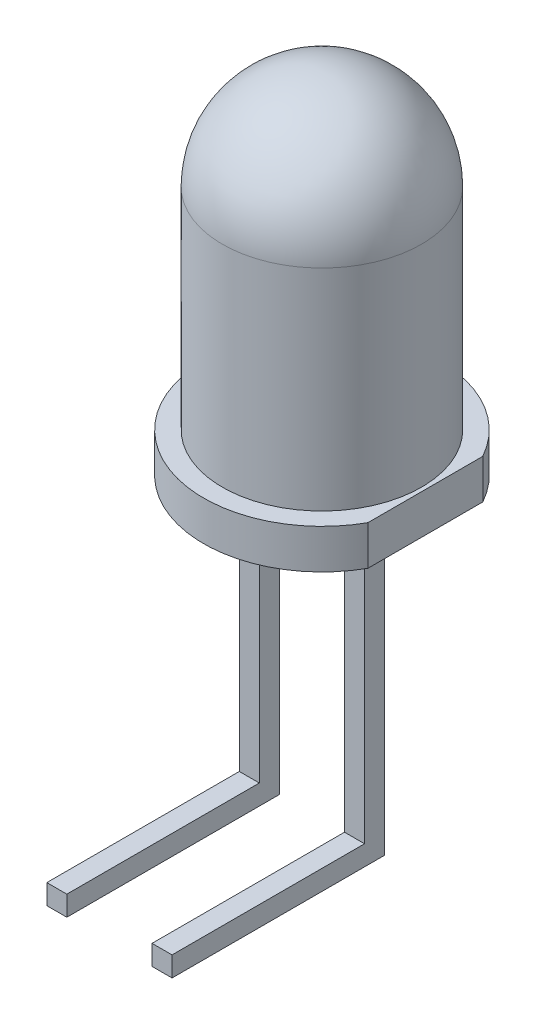
ISO-10303-21;
HEADER;
FILE_DESCRIPTION(('STEP AP214'),'2;1');
FILE_NAME('part.step','',(''),(''),'','','');
FILE_SCHEMA(('AUTOMOTIVE_DESIGN { 1 0 10303 214 1 1 1 1 }'));
ENDSEC;
DATA;
#1=APPLICATION_CONTEXT('core data for automotive mechanical design processes');
#2=APPLICATION_PROTOCOL_DEFINITION('international standard','automotive_design',2000,#1);
#3=PRODUCT_CONTEXT('',#1,'mechanical');
#4=PRODUCT('Part','Part','',(#3));
#5=PRODUCT_RELATED_PRODUCT_CATEGORY('part','',(#4));
#6=PRODUCT_DEFINITION_FORMATION('','',#4);
#7=PRODUCT_DEFINITION_CONTEXT('part definition',#1,'design');
#8=PRODUCT_DEFINITION('design','',#6,#7);
#9=PRODUCT_DEFINITION_SHAPE('','',#8);
#10=(LENGTH_UNIT() NAMED_UNIT(*) SI_UNIT(.MILLI.,.METRE.));
#11=(NAMED_UNIT(*) PLANE_ANGLE_UNIT() SI_UNIT($,.RADIAN.));
#12=(NAMED_UNIT(*) SI_UNIT($,.STERADIAN.) SOLID_ANGLE_UNIT());
#13=UNCERTAINTY_MEASURE_WITH_UNIT(LENGTH_MEASURE(1.E-05),#10,'distance_accuracy_value','');
#14=(GEOMETRIC_REPRESENTATION_CONTEXT(3) GLOBAL_UNCERTAINTY_ASSIGNED_CONTEXT((#13)) GLOBAL_UNIT_ASSIGNED_CONTEXT((#10,
#11,#12)) REPRESENTATION_CONTEXT('',''));
#15=CARTESIAN_POINT('',(0.,0.,0.));
#16=DIRECTION('',(0.,0.,1.));
#17=DIRECTION('',(1.,0.,0.));
#18=AXIS2_PLACEMENT_3D('',#15,#16,#17);
#19=CARTESIAN_POINT('',(1.5494,-8.3439,0.4953));
#20=DIRECTION('',(0.,0.,-1.));
#21=DIRECTION('',(-1.,0.,0.));
#22=AXIS2_PLACEMENT_3D('',#19,#20,#21);
#23=PLANE('',#22);
#24=DIRECTION('',(-1.,0.,0.));
#25=VECTOR('',#24,1.);
#26=CARTESIAN_POINT('',(1.0541,-7.8486,0.4953));
#27=LINE('',#26,#25);
#28=CARTESIAN_POINT('',(1.5494,-7.8486,0.4953));
#29=VERTEX_POINT('',#28);
#30=CARTESIAN_POINT('',(1.0541,-7.8486,0.4953));
#31=VERTEX_POINT('',#30);
#32=EDGE_CURVE('E54',#29,#31,#27,.T.);
#33=ORIENTED_EDGE('',*,*,#32,.F.);
#34=DIRECTION('',(0.,1.,0.));
#35=VECTOR('',#34,1.);
#36=CARTESIAN_POINT('',(1.5494,-0.977899999999999,0.4953));
#37=LINE('',#36,#35);
#38=CARTESIAN_POINT('',(1.5494,-0.9779,0.4953));
#39=VERTEX_POINT('',#38);
#40=EDGE_CURVE('E159',#29,#39,#37,.T.);
#41=ORIENTED_EDGE('',*,*,#40,.T.);
#42=DIRECTION('',(-1.,0.,0.));
#43=VECTOR('',#42,1.);
#44=CARTESIAN_POINT('',(1.5494,-0.977899999999999,0.4953));
#45=LINE('',#44,#43);
#46=CARTESIAN_POINT('',(1.0541,-0.9779,0.4953));
#47=VERTEX_POINT('',#46);
#48=EDGE_CURVE('E186',#39,#47,#45,.T.);
#49=ORIENTED_EDGE('',*,*,#48,.T.);
#50=DIRECTION('',(0.,-1.,0.));
#51=VECTOR('',#50,1.);
#52=CARTESIAN_POINT('',(1.0541,-0.9779,0.4953));
#53=LINE('',#52,#51);
#54=EDGE_CURVE('E50',#47,#31,#53,.T.);
#55=ORIENTED_EDGE('',*,*,#54,.T.);
#56=EDGE_LOOP('',(#33,#41,#49,#55));
#57=FACE_BOUND('',#56,.T.);
#58=ADVANCED_FACE('F35',(#57),#23,.F.);
#59=CARTESIAN_POINT('',(-1.0541,-8.3439,0.4953));
#60=DIRECTION('',(0.,0.,1.));
#61=DIRECTION('',(1.,0.,0.));
#62=AXIS2_PLACEMENT_3D('',#59,#60,#61);
#63=PLANE('',#62);
#64=DIRECTION('',(0.,-1.,0.));
#65=VECTOR('',#64,1.);
#66=CARTESIAN_POINT('',(-1.5494,-0.9779,0.4953));
#67=LINE('',#66,#65);
#68=CARTESIAN_POINT('',(-1.5494,-0.9779,0.4953));
#69=VERTEX_POINT('',#68);
#70=CARTESIAN_POINT('',(-1.5494,-7.8486,0.4953));
#71=VERTEX_POINT('',#70);
#72=EDGE_CURVE('E212',#69,#71,#67,.T.);
#73=ORIENTED_EDGE('',*,*,#72,.T.);
#74=DIRECTION('',(-1.,0.,0.));
#75=VECTOR('',#74,1.);
#76=CARTESIAN_POINT('',(-1.5494,-7.8486,0.4953));
#77=LINE('',#76,#75);
#78=CARTESIAN_POINT('',(-1.0541,-7.8486,0.4953));
#79=VERTEX_POINT('',#78);
#80=EDGE_CURVE('E160',#79,#71,#77,.T.);
#81=ORIENTED_EDGE('',*,*,#80,.F.);
#82=DIRECTION('',(0.,1.,0.));
#83=VECTOR('',#82,1.);
#84=CARTESIAN_POINT('',(-1.0541,-0.9779,0.4953));
#85=LINE('',#84,#83);
#86=CARTESIAN_POINT('',(-1.0541,-0.9779,0.4953));
#87=VERTEX_POINT('',#86);
#88=EDGE_CURVE('E207',#79,#87,#85,.T.);
#89=ORIENTED_EDGE('',*,*,#88,.T.);
#90=DIRECTION('',(-1.,0.,0.));
#91=VECTOR('',#90,1.);
#92=CARTESIAN_POINT('',(-1.5494,-0.9779,0.4953));
#93=LINE('',#92,#91);
#94=EDGE_CURVE('E209',#87,#69,#93,.T.);
#95=ORIENTED_EDGE('',*,*,#94,.T.);
#96=EDGE_LOOP('',(#73,#81,#89,#95));
#97=FACE_BOUND('',#96,.T.);
#98=ADVANCED_FACE('F264',(#97),#63,.T.);
#99=CARTESIAN_POINT('',(0.,-0.9779,0.));
#100=DIRECTION('',(0.,-1.,0.));
#101=DIRECTION('',(0.,0.,-1.));
#102=AXIS2_PLACEMENT_3D('',#99,#100,#101);
#103=PLANE('',#102);
#104=CARTESIAN_POINT('',(0.,-0.9779,0.));
#105=DIRECTION('',(0.,-1.,0.));
#106=DIRECTION('',(0.,0.,-1.));
#107=AXIS2_PLACEMENT_3D('',#104,#105,#106);
#108=CIRCLE('',#107,2.92735);
#109=CARTESIAN_POINT('',(2.55905,-0.9779,1.42149256769073));
#110=VERTEX_POINT('',#109);
#111=CARTESIAN_POINT('',(2.55905,-0.9779,-1.42149256769073));
#112=VERTEX_POINT('',#111);
#113=EDGE_CURVE('E235',#110,#112,#108,.T.);
#114=ORIENTED_EDGE('',*,*,#113,.T.);
#115=DIRECTION('',(0.,0.,1.));
#116=VECTOR('',#115,1.);
#117=CARTESIAN_POINT('',(2.55905,-0.9779,1.42149256769073));
#118=LINE('',#117,#116);
#119=EDGE_CURVE('E238',#112,#110,#118,.T.);
#120=ORIENTED_EDGE('',*,*,#119,.T.);
#121=EDGE_LOOP('',(#114,#120));
#122=FACE_BOUND('',#121,.T.);
#123=ORIENTED_EDGE('',*,*,#94,.F.);
#124=DIRECTION('',(0.,0.,-1.));
#125=VECTOR('',#124,1.);
#126=CARTESIAN_POINT('',(-1.0541,-0.9779,0.4953));
#127=LINE('',#126,#125);
#128=CARTESIAN_POINT('',(-1.0541,-0.9779,0.));
#129=VERTEX_POINT('',#128);
#130=EDGE_CURVE('E231',#87,#129,#127,.T.);
#131=ORIENTED_EDGE('',*,*,#130,.T.);
#132=DIRECTION('',(-1.,0.,0.));
#133=VECTOR('',#132,1.);
#134=CARTESIAN_POINT('',(-1.5494,-0.9779,0.));
#135=LINE('',#134,#133);
#136=CARTESIAN_POINT('',(-1.5494,-0.9779,0.));
#137=VERTEX_POINT('',#136);
#138=EDGE_CURVE('E217',#129,#137,#135,.T.);
#139=ORIENTED_EDGE('',*,*,#138,.T.);
#140=DIRECTION('',(0.,0.,-1.));
#141=VECTOR('',#140,1.);
#142=CARTESIAN_POINT('',(-1.5494,-0.9779,0.4953));
#143=LINE('',#142,#141);
#144=EDGE_CURVE('E228',#69,#137,#143,.T.);
#145=ORIENTED_EDGE('',*,*,#144,.F.);
#146=EDGE_LOOP('',(#123,#131,#139,#145));
#147=FACE_BOUND('',#146,.T.);
#148=DIRECTION('',(0.,0.,-1.));
#149=VECTOR('',#148,1.);
#150=CARTESIAN_POINT('',(1.0541,-0.9779,0.4953));
#151=LINE('',#150,#149);
#152=CARTESIAN_POINT('',(1.0541,-0.9779,0.));
#153=VERTEX_POINT('',#152);
#154=EDGE_CURVE('E201',#47,#153,#151,.T.);
#155=ORIENTED_EDGE('',*,*,#154,.F.);
#156=ORIENTED_EDGE('',*,*,#48,.F.);
#157=DIRECTION('',(0.,0.,-1.));
#158=VECTOR('',#157,1.);
#159=CARTESIAN_POINT('',(1.5494,-0.977899999999999,0.4953));
#160=LINE('',#159,#158);
#161=CARTESIAN_POINT('',(1.5494,-0.977899999999999,0.));
#162=VERTEX_POINT('',#161);
#163=EDGE_CURVE('E204',#39,#162,#160,.T.);
#164=ORIENTED_EDGE('',*,*,#163,.T.);
#165=DIRECTION('',(-1.,0.,0.));
#166=VECTOR('',#165,1.);
#167=CARTESIAN_POINT('',(1.5494,-0.977899999999999,0.));
#168=LINE('',#167,#166);
#169=EDGE_CURVE('E192',#162,#153,#168,.T.);
#170=ORIENTED_EDGE('',*,*,#169,.T.);
#171=EDGE_LOOP('',(#155,#156,#164,#170));
#172=FACE_BOUND('',#171,.T.);
#173=ADVANCED_FACE('F260',(#122,#147,#172),#103,.T.);
#174=CARTESIAN_POINT('',(0.,5.207,0.));
#175=DIRECTION('',(0.,-1.,0.));
#176=DIRECTION('',(-1.,0.,0.));
#177=AXIS2_PLACEMENT_3D('',#174,#175,#176);
#178=SPHERICAL_SURFACE('',#177,2.4638);
#179=CARTESIAN_POINT('',(0.,5.207,0.));
#180=DIRECTION('',(0.,-1.,0.));
#181=DIRECTION('',(0.,0.,-1.));
#182=AXIS2_PLACEMENT_3D('',#179,#180,#181);
#183=CIRCLE('',#182,2.4638);
#184=CARTESIAN_POINT('',(0.,5.207,-2.4638));
#185=VERTEX_POINT('',#184);
#186=EDGE_CURVE('E11',#185,#185,#183,.T.);
#187=ORIENTED_EDGE('',*,*,#186,.F.);
#188=EDGE_LOOP('',(#187));
#189=FACE_BOUND('',#188,.T.);
#190=ADVANCED_FACE('F37',(#189),#178,.T.);
#191=CARTESIAN_POINT('',(0.,0.,0.));
#192=DIRECTION('',(0.,-1.,0.));
#193=DIRECTION('',(0.,0.,-1.));
#194=AXIS2_PLACEMENT_3D('',#191,#192,#193);
#195=CYLINDRICAL_SURFACE('',#194,2.4638);
#196=CARTESIAN_POINT('',(0.,0.,0.));
#197=DIRECTION('',(0.,-1.,0.));
#198=DIRECTION('',(0.,0.,-1.));
#199=AXIS2_PLACEMENT_3D('',#196,#197,#198);
#200=CIRCLE('',#199,2.4638);
#201=CARTESIAN_POINT('',(0.,0.,-2.4638));
#202=VERTEX_POINT('',#201);
#203=EDGE_CURVE('E43',#202,#202,#200,.T.);
#204=ORIENTED_EDGE('',*,*,#203,.F.);
#205=EDGE_LOOP('',(#204));
#206=FACE_BOUND('',#205,.T.);
#207=ORIENTED_EDGE('',*,*,#186,.T.);
#208=EDGE_LOOP('',(#207));
#209=FACE_BOUND('',#208,.T.);
#210=ADVANCED_FACE('F254',(#206,#209),#195,.T.);
#211=CARTESIAN_POINT('',(0.,0.,0.));
#212=DIRECTION('',(0.,-1.,0.));
#213=DIRECTION('',(0.,0.,-1.));
#214=AXIS2_PLACEMENT_3D('',#211,#212,#213);
#215=PLANE('',#214);
#216=CARTESIAN_POINT('',(0.,0.,0.));
#217=DIRECTION('',(0.,-1.,0.));
#218=DIRECTION('',(0.,0.,-1.));
#219=AXIS2_PLACEMENT_3D('',#216,#217,#218);
#220=CIRCLE('',#219,2.92735);
#221=CARTESIAN_POINT('',(2.55905,0.,1.42149256769073));
#222=VERTEX_POINT('',#221);
#223=CARTESIAN_POINT('',(2.55905,0.,-1.42149256769073));
#224=VERTEX_POINT('',#223);
#225=EDGE_CURVE('E234',#222,#224,#220,.T.);
#226=ORIENTED_EDGE('',*,*,#225,.F.);
#227=DIRECTION('',(0.,0.,1.));
#228=VECTOR('',#227,1.);
#229=CARTESIAN_POINT('',(2.55905,0.,1.42149256769073));
#230=LINE('',#229,#228);
#231=EDGE_CURVE('E239',#224,#222,#230,.T.);
#232=ORIENTED_EDGE('',*,*,#231,.F.);
#233=EDGE_LOOP('',(#226,#232));
#234=FACE_BOUND('',#233,.T.);
#235=ORIENTED_EDGE('',*,*,#203,.T.);
#236=EDGE_LOOP('',(#235));
#237=FACE_BOUND('',#236,.T.);
#238=ADVANCED_FACE('F252',(#234,#237),#215,.F.);
#239=CARTESIAN_POINT('',(0.,-0.9779,0.));
#240=DIRECTION('',(0.,1.,0.));
#241=DIRECTION('',(0.,0.,1.));
#242=AXIS2_PLACEMENT_3D('',#239,#240,#241);
#243=CYLINDRICAL_SURFACE('',#242,2.92735);
#244=ORIENTED_EDGE('',*,*,#225,.T.);
#245=DIRECTION('',(0.,1.,0.));
#246=VECTOR('',#245,1.);
#247=CARTESIAN_POINT('',(2.55905,-0.9779,-1.42149256769073));
#248=LINE('',#247,#246);
#249=EDGE_CURVE('E247',#112,#224,#248,.T.);
#250=ORIENTED_EDGE('',*,*,#249,.F.);
#251=ORIENTED_EDGE('',*,*,#113,.F.);
#252=DIRECTION('',(0.,1.,0.));
#253=VECTOR('',#252,1.);
#254=CARTESIAN_POINT('',(2.55905,-0.9779,1.42149256769073));
#255=LINE('',#254,#253);
#256=EDGE_CURVE('E241',#110,#222,#255,.T.);
#257=ORIENTED_EDGE('',*,*,#256,.T.);
#258=EDGE_LOOP('',(#244,#250,#251,#257));
#259=FACE_BOUND('',#258,.T.);
#260=ADVANCED_FACE('F311',(#259),#243,.T.);
#261=CARTESIAN_POINT('',(2.55905,-0.9779,1.42149256769073));
#262=DIRECTION('',(-1.,0.,0.));
#263=DIRECTION('',(0.,0.,1.));
#264=AXIS2_PLACEMENT_3D('',#261,#262,#263);
#265=PLANE('',#264);
#266=ORIENTED_EDGE('',*,*,#231,.T.);
#267=ORIENTED_EDGE('',*,*,#256,.F.);
#268=ORIENTED_EDGE('',*,*,#119,.F.);
#269=ORIENTED_EDGE('',*,*,#249,.T.);
#270=EDGE_LOOP('',(#266,#267,#268,#269));
#271=FACE_BOUND('',#270,.T.);
#272=ADVANCED_FACE('F306',(#271),#265,.F.);
#273=CARTESIAN_POINT('',(-1.0541,-0.9779,0.4953));
#274=DIRECTION('',(-1.,0.,0.));
#275=DIRECTION('',(0.,-1.,0.));
#276=AXIS2_PLACEMENT_3D('',#273,#274,#275);
#277=PLANE('',#276);
#278=DIRECTION('',(0.,1.,0.));
#279=VECTOR('',#278,1.);
#280=CARTESIAN_POINT('',(-1.0541,-0.9779,0.));
#281=LINE('',#280,#279);
#282=CARTESIAN_POINT('',(-1.0541,-8.3439,0.));
#283=VERTEX_POINT('',#282);
#284=EDGE_CURVE('E206',#283,#129,#281,.T.);
#285=ORIENTED_EDGE('',*,*,#284,.T.);
#286=ORIENTED_EDGE('',*,*,#130,.F.);
#287=ORIENTED_EDGE('',*,*,#88,.F.);
#288=DIRECTION('',(0.,0.,-1.));
#289=VECTOR('',#288,1.);
#290=CARTESIAN_POINT('',(-1.0541,-7.8486,5.2578));
#291=LINE('',#290,#289);
#292=CARTESIAN_POINT('',(-1.0541,-7.8486,5.2578));
#293=VERTEX_POINT('',#292);
#294=EDGE_CURVE('E181',#293,#79,#291,.T.);
#295=ORIENTED_EDGE('',*,*,#294,.F.);
#296=DIRECTION('',(0.,1.,0.));
#297=VECTOR('',#296,1.);
#298=CARTESIAN_POINT('',(-1.0541,-7.8486,5.2578));
#299=LINE('',#298,#297);
#300=CARTESIAN_POINT('',(-1.0541,-8.3439,5.2578));
#301=VERTEX_POINT('',#300);
#302=EDGE_CURVE('E163',#301,#293,#299,.T.);
#303=ORIENTED_EDGE('',*,*,#302,.F.);
#304=DIRECTION('',(0.,0.,-1.));
#305=VECTOR('',#304,1.);
#306=CARTESIAN_POINT('',(-1.0541,-8.3439,0.4953));
#307=LINE('',#306,#305);
#308=EDGE_CURVE('E214',#301,#283,#307,.T.);
#309=ORIENTED_EDGE('',*,*,#308,.T.);
#310=EDGE_LOOP('',(#285,#286,#287,#295,#303,#309));
#311=FACE_BOUND('',#310,.T.);
#312=ADVANCED_FACE('F303',(#311),#277,.F.);
#313=CARTESIAN_POINT('',(-1.5494,-0.9779,0.4953));
#314=DIRECTION('',(1.,0.,0.));
#315=DIRECTION('',(0.,1.,0.));
#316=AXIS2_PLACEMENT_3D('',#313,#314,#315);
#317=PLANE('',#316);
#318=DIRECTION('',(0.,-1.,0.));
#319=VECTOR('',#318,1.);
#320=CARTESIAN_POINT('',(-1.5494,-0.9779,0.));
#321=LINE('',#320,#319);
#322=CARTESIAN_POINT('',(-1.5494,-8.3439,0.));
#323=VERTEX_POINT('',#322);
#324=EDGE_CURVE('E220',#137,#323,#321,.T.);
#325=ORIENTED_EDGE('',*,*,#324,.T.);
#326=DIRECTION('',(0.,0.,-1.));
#327=VECTOR('',#326,1.);
#328=CARTESIAN_POINT('',(-1.5494,-8.3439,0.4953));
#329=LINE('',#328,#327);
#330=CARTESIAN_POINT('',(-1.5494,-8.3439,5.2578));
#331=VERTEX_POINT('',#330);
#332=EDGE_CURVE('E225',#331,#323,#329,.T.);
#333=ORIENTED_EDGE('',*,*,#332,.F.);
#334=DIRECTION('',(0.,-1.,0.));
#335=VECTOR('',#334,1.);
#336=CARTESIAN_POINT('',(-1.5494,-7.8486,5.2578));
#337=LINE('',#336,#335);
#338=CARTESIAN_POINT('',(-1.5494,-7.8486,5.2578));
#339=VERTEX_POINT('',#338);
#340=EDGE_CURVE('E172',#339,#331,#337,.T.);
#341=ORIENTED_EDGE('',*,*,#340,.F.);
#342=DIRECTION('',(0.,0.,-1.));
#343=VECTOR('',#342,1.);
#344=CARTESIAN_POINT('',(-1.5494,-7.8486,5.2578));
#345=LINE('',#344,#343);
#346=EDGE_CURVE('E177',#339,#71,#345,.T.);
#347=ORIENTED_EDGE('',*,*,#346,.T.);
#348=ORIENTED_EDGE('',*,*,#72,.F.);
#349=ORIENTED_EDGE('',*,*,#144,.T.);
#350=EDGE_LOOP('',(#325,#333,#341,#347,#348,#349));
#351=FACE_BOUND('',#350,.T.);
#352=ADVANCED_FACE('F299',(#351),#317,.F.);
#353=CARTESIAN_POINT('',(-1.5494,-8.3439,0.4953));
#354=DIRECTION('',(0.,1.,0.));
#355=DIRECTION('',(0.,0.,1.));
#356=AXIS2_PLACEMENT_3D('',#353,#354,#355);
#357=PLANE('',#356);
#358=DIRECTION('',(1.,0.,0.));
#359=VECTOR('',#358,1.);
#360=CARTESIAN_POINT('',(-1.5494,-8.3439,0.));
#361=LINE('',#360,#359);
#362=EDGE_CURVE('E210',#323,#283,#361,.T.);
#363=ORIENTED_EDGE('',*,*,#362,.T.);
#364=ORIENTED_EDGE('',*,*,#308,.F.);
#365=DIRECTION('',(1.,0.,0.));
#366=VECTOR('',#365,1.);
#367=CARTESIAN_POINT('',(-1.5494,-8.3439,5.2578));
#368=LINE('',#367,#366);
#369=EDGE_CURVE('E175',#331,#301,#368,.T.);
#370=ORIENTED_EDGE('',*,*,#369,.F.);
#371=ORIENTED_EDGE('',*,*,#332,.T.);
#372=EDGE_LOOP('',(#363,#364,#370,#371));
#373=FACE_BOUND('',#372,.T.);
#374=ADVANCED_FACE('F295',(#373),#357,.F.);
#375=CARTESIAN_POINT('',(-1.0541,-8.3439,0.));
#376=DIRECTION('',(0.,0.,1.));
#377=DIRECTION('',(1.,0.,0.));
#378=AXIS2_PLACEMENT_3D('',#375,#376,#377);
#379=PLANE('',#378);
#380=ORIENTED_EDGE('',*,*,#284,.F.);
#381=ORIENTED_EDGE('',*,*,#362,.F.);
#382=ORIENTED_EDGE('',*,*,#324,.F.);
#383=ORIENTED_EDGE('',*,*,#138,.F.);
#384=EDGE_LOOP('',(#380,#381,#382,#383));
#385=FACE_BOUND('',#384,.T.);
#386=ADVANCED_FACE('F291',(#385),#379,.F.);
#387=CARTESIAN_POINT('',(1.5494,-0.977899999999999,0.4953));
#388=DIRECTION('',(-1.,0.,0.));
#389=DIRECTION('',(0.,-1.,0.));
#390=AXIS2_PLACEMENT_3D('',#387,#388,#389);
#391=PLANE('',#390);
#392=DIRECTION('',(0.,1.,0.));
#393=VECTOR('',#392,1.);
#394=CARTESIAN_POINT('',(1.5494,-0.977899999999999,0.));
#395=LINE('',#394,#393);
#396=CARTESIAN_POINT('',(1.5494,-8.3439,0.));
#397=VERTEX_POINT('',#396);
#398=EDGE_CURVE('E184',#397,#162,#395,.T.);
#399=ORIENTED_EDGE('',*,*,#398,.T.);
#400=ORIENTED_EDGE('',*,*,#163,.F.);
#401=ORIENTED_EDGE('',*,*,#40,.F.);
#402=DIRECTION('',(0.,0.,-1.));
#403=VECTOR('',#402,1.);
#404=CARTESIAN_POINT('',(1.5494,-7.8486,5.2578));
#405=LINE('',#404,#403);
#406=CARTESIAN_POINT('',(1.5494,-7.8486,5.2578));
#407=VERTEX_POINT('',#406);
#408=EDGE_CURVE('E139',#407,#29,#405,.T.);
#409=ORIENTED_EDGE('',*,*,#408,.F.);
#410=DIRECTION('',(0.,1.,0.));
#411=VECTOR('',#410,1.);
#412=CARTESIAN_POINT('',(1.5494,-7.8486,5.2578));
#413=LINE('',#412,#411);
#414=CARTESIAN_POINT('',(1.5494,-8.3439,5.2578));
#415=VERTEX_POINT('',#414);
#416=EDGE_CURVE('E146',#415,#407,#413,.T.);
#417=ORIENTED_EDGE('',*,*,#416,.F.);
#418=DIRECTION('',(0.,0.,-1.));
#419=VECTOR('',#418,1.);
#420=CARTESIAN_POINT('',(1.5494,-8.3439,0.4953));
#421=LINE('',#420,#419);
#422=EDGE_CURVE('E190',#415,#397,#421,.T.);
#423=ORIENTED_EDGE('',*,*,#422,.T.);
#424=EDGE_LOOP('',(#399,#400,#401,#409,#417,#423));
#425=FACE_BOUND('',#424,.T.);
#426=ADVANCED_FACE('F157',(#425),#391,.F.);
#427=CARTESIAN_POINT('',(1.0541,-0.9779,0.4953));
#428=DIRECTION('',(1.,0.,0.));
#429=DIRECTION('',(0.,1.,0.));
#430=AXIS2_PLACEMENT_3D('',#427,#428,#429);
#431=PLANE('',#430);
#432=DIRECTION('',(0.,-1.,0.));
#433=VECTOR('',#432,1.);
#434=CARTESIAN_POINT('',(1.0541,-0.9779,0.));
#435=LINE('',#434,#433);
#436=CARTESIAN_POINT('',(1.0541,-8.3439,0.));
#437=VERTEX_POINT('',#436);
#438=EDGE_CURVE('E194',#153,#437,#435,.T.);
#439=ORIENTED_EDGE('',*,*,#438,.T.);
#440=DIRECTION('',(0.,0.,-1.));
#441=VECTOR('',#440,1.);
#442=CARTESIAN_POINT('',(1.0541,-8.3439,0.4953));
#443=LINE('',#442,#441);
#444=CARTESIAN_POINT('',(1.0541,-8.3439,5.2578));
#445=VERTEX_POINT('',#444);
#446=EDGE_CURVE('E198',#445,#437,#443,.T.);
#447=ORIENTED_EDGE('',*,*,#446,.F.);
#448=DIRECTION('',(0.,-1.,0.));
#449=VECTOR('',#448,1.);
#450=CARTESIAN_POINT('',(1.0541,-7.8486,5.2578));
#451=LINE('',#450,#449);
#452=CARTESIAN_POINT('',(1.0541,-7.8486,5.2578));
#453=VERTEX_POINT('',#452);
#454=EDGE_CURVE('E145',#453,#445,#451,.T.);
#455=ORIENTED_EDGE('',*,*,#454,.F.);
#456=DIRECTION('',(0.,0.,-1.));
#457=VECTOR('',#456,1.);
#458=CARTESIAN_POINT('',(1.0541,-7.8486,5.2578));
#459=LINE('',#458,#457);
#460=EDGE_CURVE('E141',#453,#31,#459,.T.);
#461=ORIENTED_EDGE('',*,*,#460,.T.);
#462=ORIENTED_EDGE('',*,*,#54,.F.);
#463=ORIENTED_EDGE('',*,*,#154,.T.);
#464=EDGE_LOOP('',(#439,#447,#455,#461,#462,#463));
#465=FACE_BOUND('',#464,.T.);
#466=ADVANCED_FACE('F285',(#465),#431,.F.);
#467=CARTESIAN_POINT('',(1.5494,-8.3439,0.4953));
#468=DIRECTION('',(0.,1.,0.));
#469=DIRECTION('',(0.,0.,1.));
#470=AXIS2_PLACEMENT_3D('',#467,#468,#469);
#471=PLANE('',#470);
#472=DIRECTION('',(1.,0.,0.));
#473=VECTOR('',#472,1.);
#474=CARTESIAN_POINT('',(1.5494,-8.3439,0.));
#475=LINE('',#474,#473);
#476=EDGE_CURVE('E187',#437,#397,#475,.T.);
#477=ORIENTED_EDGE('',*,*,#476,.T.);
#478=ORIENTED_EDGE('',*,*,#422,.F.);
#479=DIRECTION('',(1.,0.,0.));
#480=VECTOR('',#479,1.);
#481=CARTESIAN_POINT('',(1.0541,-8.3439,5.2578));
#482=LINE('',#481,#480);
#483=EDGE_CURVE('E152',#445,#415,#482,.T.);
#484=ORIENTED_EDGE('',*,*,#483,.F.);
#485=ORIENTED_EDGE('',*,*,#446,.T.);
#486=EDGE_LOOP('',(#477,#478,#484,#485));
#487=FACE_BOUND('',#486,.T.);
#488=ADVANCED_FACE('F281',(#487),#471,.F.);
#489=CARTESIAN_POINT('',(1.5494,-8.3439,0.));
#490=DIRECTION('',(0.,0.,-1.));
#491=DIRECTION('',(-1.,0.,0.));
#492=AXIS2_PLACEMENT_3D('',#489,#490,#491);
#493=PLANE('',#492);
#494=ORIENTED_EDGE('',*,*,#398,.F.);
#495=ORIENTED_EDGE('',*,*,#476,.F.);
#496=ORIENTED_EDGE('',*,*,#438,.F.);
#497=ORIENTED_EDGE('',*,*,#169,.F.);
#498=EDGE_LOOP('',(#494,#495,#496,#497));
#499=FACE_BOUND('',#498,.T.);
#500=ADVANCED_FACE('F278',(#499),#493,.T.);
#501=CARTESIAN_POINT('',(-1.5494,-7.8486,5.2578));
#502=DIRECTION('',(0.,-1.,0.));
#503=DIRECTION('',(0.,0.,-1.));
#504=AXIS2_PLACEMENT_3D('',#501,#502,#503);
#505=PLANE('',#504);
#506=ORIENTED_EDGE('',*,*,#80,.T.);
#507=ORIENTED_EDGE('',*,*,#346,.F.);
#508=DIRECTION('',(-1.,0.,0.));
#509=VECTOR('',#508,1.);
#510=CARTESIAN_POINT('',(-1.5494,-7.8486,5.2578));
#511=LINE('',#510,#509);
#512=EDGE_CURVE('E170',#293,#339,#511,.T.);
#513=ORIENTED_EDGE('',*,*,#512,.F.);
#514=ORIENTED_EDGE('',*,*,#294,.T.);
#515=EDGE_LOOP('',(#506,#507,#513,#514));
#516=FACE_BOUND('',#515,.T.);
#517=ADVANCED_FACE('F276',(#516),#505,.F.);
#518=CARTESIAN_POINT('',(-1.0541,-8.3439,5.2578));
#519=DIRECTION('',(0.,0.,1.));
#520=DIRECTION('',(1.,0.,0.));
#521=AXIS2_PLACEMENT_3D('',#518,#519,#520);
#522=PLANE('',#521);
#523=ORIENTED_EDGE('',*,*,#302,.T.);
#524=ORIENTED_EDGE('',*,*,#512,.T.);
#525=ORIENTED_EDGE('',*,*,#340,.T.);
#526=ORIENTED_EDGE('',*,*,#369,.T.);
#527=EDGE_LOOP('',(#523,#524,#525,#526));
#528=FACE_BOUND('',#527,.T.);
#529=ADVANCED_FACE('F347',(#528),#522,.T.);
#530=CARTESIAN_POINT('',(1.0541,-7.8486,5.2578));
#531=DIRECTION('',(0.,-1.,0.));
#532=DIRECTION('',(0.,0.,-1.));
#533=AXIS2_PLACEMENT_3D('',#530,#531,#532);
#534=PLANE('',#533);
#535=ORIENTED_EDGE('',*,*,#32,.T.);
#536=ORIENTED_EDGE('',*,*,#460,.F.);
#537=DIRECTION('',(-1.,0.,0.));
#538=VECTOR('',#537,1.);
#539=CARTESIAN_POINT('',(1.0541,-7.8486,5.2578));
#540=LINE('',#539,#538);
#541=EDGE_CURVE('E135',#407,#453,#540,.T.);
#542=ORIENTED_EDGE('',*,*,#541,.F.);
#543=ORIENTED_EDGE('',*,*,#408,.T.);
#544=EDGE_LOOP('',(#535,#536,#542,#543));
#545=FACE_BOUND('',#544,.T.);
#546=ADVANCED_FACE('F137',(#545),#534,.F.);
#547=CARTESIAN_POINT('',(1.5494,-8.3439,5.2578));
#548=DIRECTION('',(0.,0.,1.));
#549=DIRECTION('',(1.,0.,0.));
#550=AXIS2_PLACEMENT_3D('',#547,#548,#549);
#551=PLANE('',#550);
#552=ORIENTED_EDGE('',*,*,#416,.T.);
#553=ORIENTED_EDGE('',*,*,#541,.T.);
#554=ORIENTED_EDGE('',*,*,#454,.T.);
#555=ORIENTED_EDGE('',*,*,#483,.T.);
#556=EDGE_LOOP('',(#552,#553,#554,#555));
#557=FACE_BOUND('',#556,.T.);
#558=ADVANCED_FACE('F150',(#557),#551,.T.);
#559=CLOSED_SHELL('',(#58,#98,#173,#190,#210,#238,#260,#272,#312,#352,#374,#386,#426,#466,#488,
#500,#517,#529,#546,#558));
#560=MANIFOLD_SOLID_BREP('B2',#559);
#561=ADVANCED_BREP_SHAPE_REPRESENTATION('',(#18,#560),#14);
#562=SHAPE_DEFINITION_REPRESENTATION(#9,#561);
ENDSEC;
END-ISO-10303-21;
